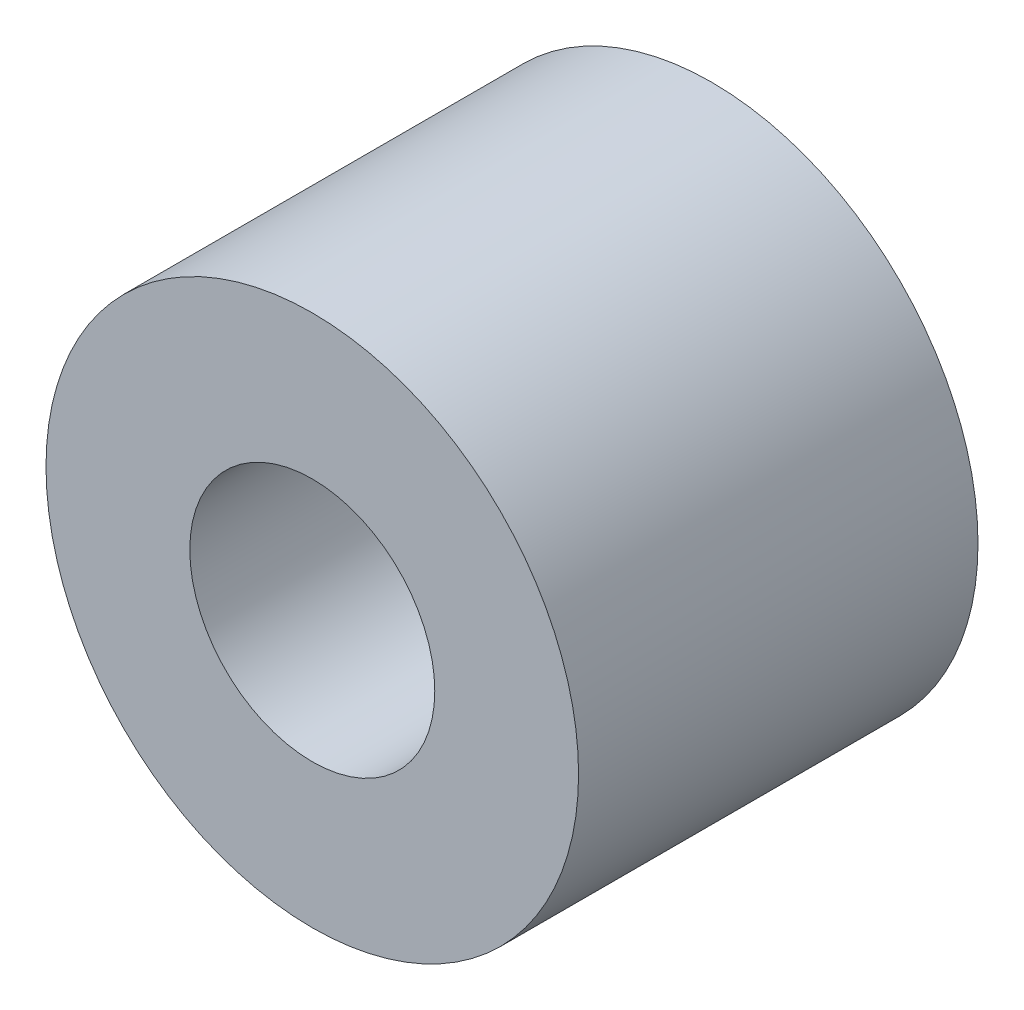
ISO-10303-21;
HEADER;
FILE_DESCRIPTION(('STEP AP214'),'2;1');
FILE_NAME('part.step','',(''),(''),'','','');
FILE_SCHEMA(('AUTOMOTIVE_DESIGN { 1 0 10303 214 1 1 1 1 }'));
ENDSEC;
DATA;
#1=APPLICATION_CONTEXT('core data for automotive mechanical design processes');
#2=APPLICATION_PROTOCOL_DEFINITION('international standard','automotive_design',2000,#1);
#3=PRODUCT_CONTEXT('',#1,'mechanical');
#4=PRODUCT('Part','Part','',(#3));
#5=PRODUCT_RELATED_PRODUCT_CATEGORY('part','',(#4));
#6=PRODUCT_DEFINITION_FORMATION('','',#4);
#7=PRODUCT_DEFINITION_CONTEXT('part definition',#1,'design');
#8=PRODUCT_DEFINITION('design','',#6,#7);
#9=PRODUCT_DEFINITION_SHAPE('','',#8);
#10=(LENGTH_UNIT() NAMED_UNIT(*) SI_UNIT(.MILLI.,.METRE.));
#11=(NAMED_UNIT(*) PLANE_ANGLE_UNIT() SI_UNIT($,.RADIAN.));
#12=(NAMED_UNIT(*) SI_UNIT($,.STERADIAN.) SOLID_ANGLE_UNIT());
#13=UNCERTAINTY_MEASURE_WITH_UNIT(LENGTH_MEASURE(1.E-05),#10,'distance_accuracy_value','');
#14=(GEOMETRIC_REPRESENTATION_CONTEXT(3) GLOBAL_UNCERTAINTY_ASSIGNED_CONTEXT((#13)) GLOBAL_UNIT_ASSIGNED_CONTEXT((#10,
#11,#12)) REPRESENTATION_CONTEXT('',''));
#15=CARTESIAN_POINT('',(0.,0.,0.));
#16=DIRECTION('',(0.,0.,1.));
#17=DIRECTION('',(1.,0.,0.));
#18=AXIS2_PLACEMENT_3D('',#15,#16,#17);
#19=CARTESIAN_POINT('',(0.,0.,2.38125));
#20=DIRECTION('',(0.,0.,1.));
#21=DIRECTION('',(1.,0.,0.));
#22=AXIS2_PLACEMENT_3D('',#19,#20,#21);
#23=PLANE('',#22);
#24=CARTESIAN_POINT('',(0.,0.,2.38125));
#25=DIRECTION('',(0.,0.,1.));
#26=DIRECTION('',(1.,0.,0.));
#27=AXIS2_PLACEMENT_3D('',#24,#25,#26);
#28=CIRCLE('',#27,3.175);
#29=CARTESIAN_POINT('',(3.175,0.,2.38125));
#30=VERTEX_POINT('',#29);
#31=EDGE_CURVE('E10',#30,#30,#28,.T.);
#32=ORIENTED_EDGE('',*,*,#31,.T.);
#33=EDGE_LOOP('',(#32));
#34=FACE_BOUND('',#33,.T.);
#35=CARTESIAN_POINT('',(0.,0.,2.38125));
#36=DIRECTION('',(0.,0.,1.));
#37=DIRECTION('',(1.,0.,0.));
#38=AXIS2_PLACEMENT_3D('',#35,#36,#37);
#39=CIRCLE('',#38,1.4605);
#40=CARTESIAN_POINT('',(1.4605,0.,2.38125));
#41=VERTEX_POINT('',#40);
#42=EDGE_CURVE('E42',#41,#41,#39,.T.);
#43=ORIENTED_EDGE('',*,*,#42,.F.);
#44=EDGE_LOOP('',(#43));
#45=FACE_BOUND('',#44,.T.);
#46=ADVANCED_FACE('F31',(#34,#45),#23,.T.);
#47=CARTESIAN_POINT('',(0.,0.,-2.38125));
#48=DIRECTION('',(0.,0.,1.));
#49=DIRECTION('',(1.,0.,0.));
#50=AXIS2_PLACEMENT_3D('',#47,#48,#49);
#51=PLANE('',#50);
#52=CARTESIAN_POINT('',(0.,0.,-2.38125));
#53=DIRECTION('',(0.,0.,1.));
#54=DIRECTION('',(1.,0.,0.));
#55=AXIS2_PLACEMENT_3D('',#52,#53,#54);
#56=CIRCLE('',#55,3.175);
#57=CARTESIAN_POINT('',(3.175,0.,-2.38125));
#58=VERTEX_POINT('',#57);
#59=EDGE_CURVE('E35',#58,#58,#56,.T.);
#60=ORIENTED_EDGE('',*,*,#59,.F.);
#61=EDGE_LOOP('',(#60));
#62=FACE_BOUND('',#61,.T.);
#63=CARTESIAN_POINT('',(0.,0.,-2.38125));
#64=DIRECTION('',(0.,0.,1.));
#65=DIRECTION('',(1.,0.,0.));
#66=AXIS2_PLACEMENT_3D('',#63,#64,#65);
#67=CIRCLE('',#66,1.4605);
#68=CARTESIAN_POINT('',(1.4605,0.,-2.38125));
#69=VERTEX_POINT('',#68);
#70=EDGE_CURVE('E44',#69,#69,#67,.T.);
#71=ORIENTED_EDGE('',*,*,#70,.T.);
#72=EDGE_LOOP('',(#71));
#73=FACE_BOUND('',#72,.T.);
#74=ADVANCED_FACE('F54',(#62,#73),#51,.F.);
#75=CARTESIAN_POINT('',(0.,0.,2.38125));
#76=DIRECTION('',(0.,0.,-1.));
#77=DIRECTION('',(-1.,0.,0.));
#78=AXIS2_PLACEMENT_3D('',#75,#76,#77);
#79=CYLINDRICAL_SURFACE('',#78,3.175);
#80=ORIENTED_EDGE('',*,*,#31,.F.);
#81=EDGE_LOOP('',(#80));
#82=FACE_BOUND('',#81,.T.);
#83=ORIENTED_EDGE('',*,*,#59,.T.);
#84=EDGE_LOOP('',(#83));
#85=FACE_BOUND('',#84,.T.);
#86=ADVANCED_FACE('F33',(#82,#85),#79,.T.);
#87=CARTESIAN_POINT('',(0.,0.,2.38125));
#88=DIRECTION('',(0.,0.,-1.));
#89=DIRECTION('',(-1.,0.,0.));
#90=AXIS2_PLACEMENT_3D('',#87,#88,#89);
#91=CYLINDRICAL_SURFACE('',#90,1.4605);
#92=ORIENTED_EDGE('',*,*,#42,.T.);
#93=EDGE_LOOP('',(#92));
#94=FACE_BOUND('',#93,.T.);
#95=ORIENTED_EDGE('',*,*,#70,.F.);
#96=EDGE_LOOP('',(#95));
#97=FACE_BOUND('',#96,.T.);
#98=ADVANCED_FACE('F50',(#94,#97),#91,.F.);
#99=CLOSED_SHELL('',(#46,#74,#86,#98));
#100=MANIFOLD_SOLID_BREP('B2',#99);
#101=ADVANCED_BREP_SHAPE_REPRESENTATION('',(#18,#100),#14);
#102=SHAPE_DEFINITION_REPRESENTATION(#9,#101);
ENDSEC;
END-ISO-10303-21;
